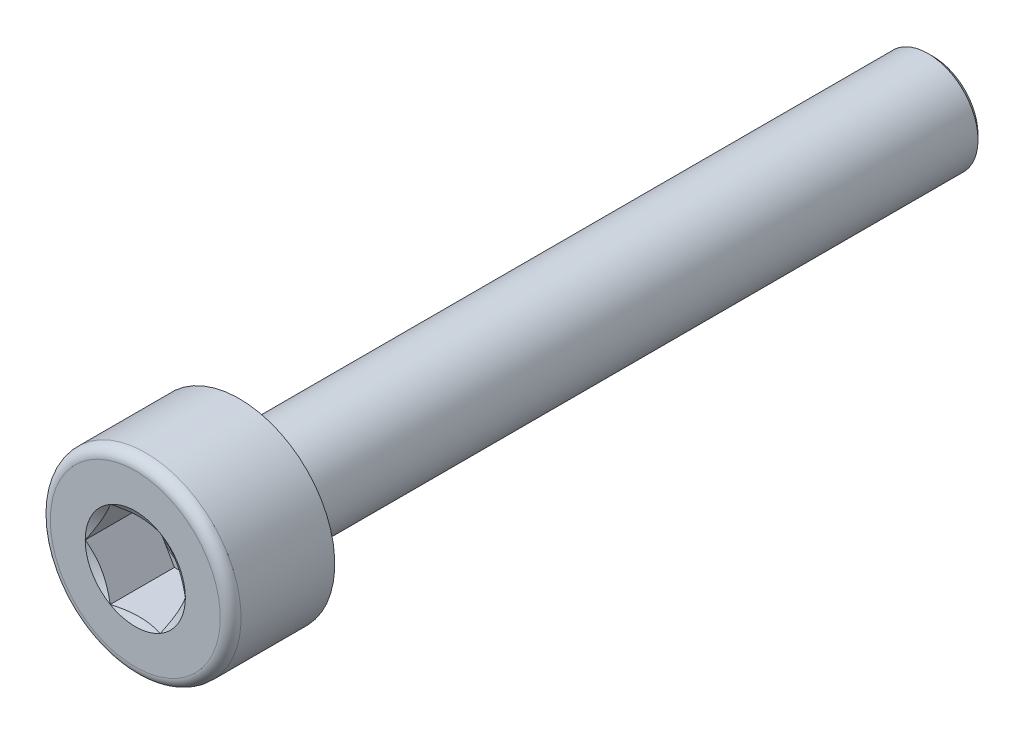
ISO-10303-21;
HEADER;
FILE_DESCRIPTION(('STEP AP214'),'2;1');
FILE_NAME('part.step','',(''),(''),'','','');
FILE_SCHEMA(('AUTOMOTIVE_DESIGN { 1 0 10303 214 1 1 1 1 }'));
ENDSEC;
DATA;
#1=APPLICATION_CONTEXT('core data for automotive mechanical design processes');
#2=APPLICATION_PROTOCOL_DEFINITION('international standard','automotive_design',2000,#1);
#3=PRODUCT_CONTEXT('',#1,'mechanical');
#4=PRODUCT('Part','Part','',(#3));
#5=PRODUCT_RELATED_PRODUCT_CATEGORY('part','',(#4));
#6=PRODUCT_DEFINITION_FORMATION('','',#4);
#7=PRODUCT_DEFINITION_CONTEXT('part definition',#1,'design');
#8=PRODUCT_DEFINITION('design','',#6,#7);
#9=PRODUCT_DEFINITION_SHAPE('','',#8);
#10=(LENGTH_UNIT() NAMED_UNIT(*) SI_UNIT(.MILLI.,.METRE.));
#11=(NAMED_UNIT(*) PLANE_ANGLE_UNIT() SI_UNIT($,.RADIAN.));
#12=(NAMED_UNIT(*) SI_UNIT($,.STERADIAN.) SOLID_ANGLE_UNIT());
#13=UNCERTAINTY_MEASURE_WITH_UNIT(LENGTH_MEASURE(1.E-05),#10,'distance_accuracy_value','');
#14=(GEOMETRIC_REPRESENTATION_CONTEXT(3) GLOBAL_UNCERTAINTY_ASSIGNED_CONTEXT((#13)) GLOBAL_UNIT_ASSIGNED_CONTEXT((#10,
#11,#12)) REPRESENTATION_CONTEXT('',''));
#15=CARTESIAN_POINT('',(0.,0.,0.));
#16=DIRECTION('',(0.,0.,1.));
#17=DIRECTION('',(1.,0.,0.));
#18=AXIS2_PLACEMENT_3D('',#15,#16,#17);
#19=CARTESIAN_POINT('',(0.,1.437,-20.));
#20=DIRECTION('',(0.,0.,1.));
#21=DIRECTION('',(1.,0.,0.));
#22=AXIS2_PLACEMENT_3D('',#19,#20,#21);
#23=PLANE('',#22);
#24=CARTESIAN_POINT('',(0.,0.,-20.));
#25=DIRECTION('',(0.,0.,1.));
#26=DIRECTION('',(1.,0.,0.));
#27=AXIS2_PLACEMENT_3D('',#24,#25,#26);
#28=CIRCLE('',#27,1.2933);
#29=CARTESIAN_POINT('',(1.2933,0.,-20.));
#30=VERTEX_POINT('',#29);
#31=EDGE_CURVE('E25',#30,#30,#28,.F.);
#32=ORIENTED_EDGE('',*,*,#31,.T.);
#33=EDGE_LOOP('',(#32));
#34=FACE_BOUND('',#33,.T.);
#35=ADVANCED_FACE('F17',(#34),#23,.F.);
#36=CARTESIAN_POINT('',(0.,0.,3.));
#37=DIRECTION('',(0.,0.,-1.));
#38=DIRECTION('',(-1.,0.,0.));
#39=AXIS2_PLACEMENT_3D('',#36,#37,#38);
#40=PLANE('',#39);
#41=CARTESIAN_POINT('',(0.,0.,3.));
#42=DIRECTION('',(0.,0.,-1.));
#43=DIRECTION('',(-1.,0.,0.));
#44=AXIS2_PLACEMENT_3D('',#41,#42,#43);
#45=CIRCLE('',#44,2.45);
#46=CARTESIAN_POINT('',(-2.45,0.,3.));
#47=VERTEX_POINT('',#46);
#48=EDGE_CURVE('E273',#47,#47,#45,.F.);
#49=ORIENTED_EDGE('',*,*,#48,.T.);
#50=EDGE_LOOP('',(#49));
#51=FACE_BOUND('',#50,.T.);
#52=CARTESIAN_POINT('',(0.,0.,3.));
#53=DIRECTION('',(0.,0.,-1.));
#54=DIRECTION('',(-1.,0.,0.));
#55=AXIS2_PLACEMENT_3D('',#52,#53,#54);
#56=CIRCLE('',#55,1.44337567297406);
#57=CARTESIAN_POINT('',(-0.721687836487033,-1.25,3.));
#58=VERTEX_POINT('',#57);
#59=CARTESIAN_POINT('',(-1.44337567297406,0.,3.));
#60=VERTEX_POINT('',#59);
#61=EDGE_CURVE('E284',#58,#60,#56,.T.);
#62=ORIENTED_EDGE('',*,*,#61,.T.);
#63=CARTESIAN_POINT('',(-0.72168783648703,1.25,3.));
#64=VERTEX_POINT('',#63);
#65=EDGE_CURVE('E107',#60,#64,#56,.T.);
#66=ORIENTED_EDGE('',*,*,#65,.T.);
#67=CARTESIAN_POINT('',(0.721687836487035,1.25,3.));
#68=VERTEX_POINT('',#67);
#69=EDGE_CURVE('E294',#64,#68,#56,.T.);
#70=ORIENTED_EDGE('',*,*,#69,.T.);
#71=CARTESIAN_POINT('',(1.44337567297406,0.,3.));
#72=VERTEX_POINT('',#71);
#73=EDGE_CURVE('E295',#68,#72,#56,.T.);
#74=ORIENTED_EDGE('',*,*,#73,.T.);
#75=CARTESIAN_POINT('',(0.721687836487033,-1.25,3.));
#76=VERTEX_POINT('',#75);
#77=EDGE_CURVE('E293',#72,#76,#56,.T.);
#78=ORIENTED_EDGE('',*,*,#77,.T.);
#79=EDGE_CURVE('E289',#76,#58,#56,.T.);
#80=ORIENTED_EDGE('',*,*,#79,.T.);
#81=EDGE_LOOP('',(#62,#66,#70,#74,#78,#80));
#82=FACE_BOUND('',#81,.T.);
#83=ADVANCED_FACE('F256',(#51,#82),#40,.F.);
#84=CARTESIAN_POINT('',(0.,0.,0.));
#85=DIRECTION('',(0.,0.,-1.));
#86=DIRECTION('',(-1.,0.,0.));
#87=AXIS2_PLACEMENT_3D('',#84,#85,#86);
#88=CYLINDRICAL_SURFACE('',#87,2.75);
#89=CARTESIAN_POINT('',(0.,0.,2.7));
#90=DIRECTION('',(0.,0.,-1.));
#91=DIRECTION('',(-1.,0.,0.));
#92=AXIS2_PLACEMENT_3D('',#89,#90,#91);
#93=CIRCLE('',#92,2.75);
#94=CARTESIAN_POINT('',(-2.75,0.,2.7));
#95=VERTEX_POINT('',#94);
#96=EDGE_CURVE('E175',#95,#95,#93,.T.);
#97=ORIENTED_EDGE('',*,*,#96,.T.);
#98=EDGE_LOOP('',(#97));
#99=FACE_BOUND('',#98,.T.);
#100=CARTESIAN_POINT('',(0.,0.,0.));
#101=DIRECTION('',(0.,0.,-1.));
#102=DIRECTION('',(-1.,0.,0.));
#103=AXIS2_PLACEMENT_3D('',#100,#101,#102);
#104=CIRCLE('',#103,2.75);
#105=CARTESIAN_POINT('',(-2.75,0.,0.));
#106=VERTEX_POINT('',#105);
#107=EDGE_CURVE('E117',#106,#106,#104,.T.);
#108=ORIENTED_EDGE('',*,*,#107,.F.);
#109=EDGE_LOOP('',(#108));
#110=FACE_BOUND('',#109,.T.);
#111=ADVANCED_FACE('F252',(#99,#110),#88,.T.);
#112=CARTESIAN_POINT('',(0.,2.75,0.));
#113=DIRECTION('',(0.,0.,1.));
#114=DIRECTION('',(1.,0.,0.));
#115=AXIS2_PLACEMENT_3D('',#112,#113,#114);
#116=PLANE('',#115);
#117=CARTESIAN_POINT('',(0.,0.,0.));
#118=DIRECTION('',(0.,0.,-1.));
#119=DIRECTION('',(-1.,0.,0.));
#120=AXIS2_PLACEMENT_3D('',#117,#118,#119);
#121=CIRCLE('',#120,1.8);
#122=CARTESIAN_POINT('',(-1.8,0.,0.));
#123=VERTEX_POINT('',#122);
#124=EDGE_CURVE('E161',#123,#123,#121,.T.);
#125=ORIENTED_EDGE('',*,*,#124,.F.);
#126=EDGE_LOOP('',(#125));
#127=FACE_BOUND('',#126,.T.);
#128=ORIENTED_EDGE('',*,*,#107,.T.);
#129=EDGE_LOOP('',(#128));
#130=FACE_BOUND('',#129,.T.);
#131=ADVANCED_FACE('F248',(#127,#130),#116,.F.);
#132=CARTESIAN_POINT('',(0.,0.,-0.100000000000001));
#133=DIRECTION('',(0.,0.,-1.));
#134=DIRECTION('',(-1.,0.,0.));
#135=AXIS2_PLACEMENT_3D('',#132,#133,#134);
#136=TOROIDAL_SURFACE('',#135,1.8,0.100000000000001);
#137=CARTESIAN_POINT('',(0.,0.,-0.0460072747777011));
#138=DIRECTION('',(0.,0.,-1.));
#139=DIRECTION('',(-1.,0.,0.));
#140=AXIS2_PLACEMENT_3D('',#137,#138,#139);
#141=CIRCLE('',#140,1.71582883140249);
#142=CARTESIAN_POINT('',(-1.71582883140249,0.,-0.0460072747777011));
#143=VERTEX_POINT('',#142);
#144=EDGE_CURVE('E158',#143,#143,#141,.T.);
#145=ORIENTED_EDGE('',*,*,#144,.F.);
#146=EDGE_LOOP('',(#145));
#147=FACE_BOUND('',#146,.T.);
#148=ORIENTED_EDGE('',*,*,#124,.T.);
#149=EDGE_LOOP('',(#148));
#150=FACE_BOUND('',#149,.T.);
#151=ADVANCED_FACE('F244',(#147,#150),#136,.F.);
#152=CARTESIAN_POINT('',(0.,0.,-0.0460072747777011));
#153=DIRECTION('',(0.,0.,1.));
#154=DIRECTION('',(1.,0.,0.));
#155=AXIS2_PLACEMENT_3D('',#152,#153,#154);
#156=CONICAL_SURFACE('',#155,1.71582883140249,0.570350678624392);
#157=CARTESIAN_POINT('',(0.,0.,-0.456007274777701));
#158=DIRECTION('',(0.,0.,-1.));
#159=DIRECTION('',(-1.,0.,0.));
#160=AXIS2_PLACEMENT_3D('',#157,#158,#159);
#161=CIRCLE('',#160,1.4528288314025);
#162=CARTESIAN_POINT('',(-1.4528288314025,0.,-0.456007274777701));
#163=VERTEX_POINT('',#162);
#164=EDGE_CURVE('E155',#163,#163,#161,.T.);
#165=ORIENTED_EDGE('',*,*,#164,.F.);
#166=EDGE_LOOP('',(#165));
#167=FACE_BOUND('',#166,.T.);
#168=ORIENTED_EDGE('',*,*,#144,.T.);
#169=EDGE_LOOP('',(#168));
#170=FACE_BOUND('',#169,.T.);
#171=ADVANCED_FACE('F240',(#167,#170),#156,.T.);
#172=CARTESIAN_POINT('',(0.,0.,-0.51));
#173=DIRECTION('',(0.,0.,-1.));
#174=DIRECTION('',(-1.,0.,0.));
#175=AXIS2_PLACEMENT_3D('',#172,#173,#174);
#176=TOROIDAL_SURFACE('',#175,1.537,0.1);
#177=CARTESIAN_POINT('',(0.,0.,-0.51));
#178=DIRECTION('',(0.,0.,-1.));
#179=DIRECTION('',(-1.,0.,0.));
#180=AXIS2_PLACEMENT_3D('',#177,#178,#179);
#181=CIRCLE('',#180,1.437);
#182=CARTESIAN_POINT('',(-1.437,0.,-0.51));
#183=VERTEX_POINT('',#182);
#184=EDGE_CURVE('E151',#183,#183,#181,.T.);
#185=ORIENTED_EDGE('',*,*,#184,.F.);
#186=EDGE_LOOP('',(#185));
#187=FACE_BOUND('',#186,.T.);
#188=ORIENTED_EDGE('',*,*,#164,.T.);
#189=EDGE_LOOP('',(#188));
#190=FACE_BOUND('',#189,.T.);
#191=ADVANCED_FACE('F236',(#187,#190),#176,.F.);
#192=CARTESIAN_POINT('',(0.,0.,0.));
#193=DIRECTION('',(0.,0.,-1.));
#194=DIRECTION('',(-1.,0.,0.));
#195=AXIS2_PLACEMENT_3D('',#192,#193,#194);
#196=CYLINDRICAL_SURFACE('',#195,1.437);
#197=CARTESIAN_POINT('',(0.,0.,-19.8563));
#198=DIRECTION('',(0.,0.,1.));
#199=DIRECTION('',(1.,0.,0.));
#200=AXIS2_PLACEMENT_3D('',#197,#198,#199);
#201=CIRCLE('',#200,1.437);
#202=CARTESIAN_POINT('',(1.437,0.,-19.8563));
#203=VERTEX_POINT('',#202);
#204=EDGE_CURVE('E11',#203,#203,#201,.T.);
#205=ORIENTED_EDGE('',*,*,#204,.T.);
#206=EDGE_LOOP('',(#205));
#207=FACE_BOUND('',#206,.T.);
#208=ORIENTED_EDGE('',*,*,#184,.T.);
#209=EDGE_LOOP('',(#208));
#210=FACE_BOUND('',#209,.T.);
#211=ADVANCED_FACE('F233',(#207,#210),#196,.T.);
#212=CARTESIAN_POINT('',(0.,0.,3.));
#213=DIRECTION('',(0.,0.,1.));
#214=DIRECTION('',(1.,0.,0.));
#215=AXIS2_PLACEMENT_3D('',#212,#213,#214);
#216=CONICAL_SURFACE('',#215,1.44337567297406,1.04719755119659);
#217=ORIENTED_EDGE('',*,*,#65,.F.);
#218=CARTESIAN_POINT('',(-1.4434911430279,-0.000199999999997675,3.00006667466602));
#219=CARTESIAN_POINT('',(-1.41177538446487,0.0547333052317676,2.98174591476369));
#220=CARTESIAN_POINT('',(-1.37978586023939,0.110140786500242,2.96508330620064));
#221=CARTESIAN_POINT('',(-1.31525277575269,0.221915367600343,2.93599730394577));
#222=CARTESIAN_POINT('',(-1.28270806805991,0.278284454841713,2.92358420197605));
#223=CARTESIAN_POINT('',(-1.21802202146378,0.390323974086987,2.90425968763601));
#224=CARTESIAN_POINT('',(-1.1858906404852,0.445977158459233,2.89721968944743));
#225=CARTESIAN_POINT('',(-1.12147653960455,0.557545653908395,2.88881243263063));
#226=CARTESIAN_POINT('',(-1.08919405413422,0.613460558937603,2.88743821520472));
#227=CARTESIAN_POINT('',(-1.02886247391297,0.717957921181728,2.89028333736792));
#228=CARTESIAN_POINT('',(-1.00080438896118,0.766555949881318,2.89380409882001));
#229=CARTESIAN_POINT('',(-0.944871034195502,0.863435362173241,2.90496711269925));
#230=CARTESIAN_POINT('',(-0.916995958125019,0.911716410192166,2.91261318557268));
#231=CARTESIAN_POINT('',(-0.860947097873546,1.00879588385404,2.93172945470053));
#232=CARTESIAN_POINT('',(-0.832780414607289,1.0575820103519,2.94328075697966));
#233=CARTESIAN_POINT('',(-0.776867365453648,1.1544262522921,2.96949831469389));
#234=CARTESIAN_POINT('',(-0.74912028215514,1.20248561032696,2.9841584021391));
#235=CARTESIAN_POINT('',(-0.721572366433193,1.2502,3.00006667466602));
#236=B_SPLINE_CURVE_WITH_KNOTS('',3,(#218,#219,#220,#221,#222,#223,#224,#225,#226,#227,#228,
#229,#230,#231,#232,#233,#234,#235),.UNSPECIFIED.,.F.,.F.,(4,2,2,2,2,2,2,2,4),(0.,
0.19815082102956,0.396778196315221,0.590488617354401,0.783961049317183,0.952480056398647,
1.1211553973001,1.2935743034359,1.4656542697693),.UNSPECIFIED.);
#237=EDGE_CURVE('E166',#60,#64,#236,.T.);
#238=ORIENTED_EDGE('',*,*,#237,.T.);
#239=EDGE_LOOP('',(#217,#238));
#240=FACE_BOUND('',#239,.T.);
#241=ADVANCED_FACE('F184',(#240),#216,.F.);
#242=CARTESIAN_POINT('',(-0.721572366433195,-1.2502,3.00006667466602));
#243=CARTESIAN_POINT('',(-0.753288124996231,-1.19526669476823,2.98174591476369));
#244=CARTESIAN_POINT('',(-0.785277649221704,-1.13985921349976,2.96508330620064));
#245=CARTESIAN_POINT('',(-0.849810733708404,-1.02808463239966,2.93599730394577));
#246=CARTESIAN_POINT('',(-0.882355441401183,-0.971715545158289,2.92358420197605));
#247=CARTESIAN_POINT('',(-0.947041487997319,-0.859676025913014,2.90425968763601));
#248=CARTESIAN_POINT('',(-0.979172868975895,-0.804022841540769,2.89721968944743));
#249=CARTESIAN_POINT('',(-1.04358696985655,-0.692454346091607,2.88881243263063));
#250=CARTESIAN_POINT('',(-1.07586945532688,-0.636539441062398,2.88743821520472));
#251=CARTESIAN_POINT('',(-1.13620103554813,-0.532042078818273,2.89028333736791));
#252=CARTESIAN_POINT('',(-1.16425912049992,-0.483444050118683,2.89380409882001));
#253=CARTESIAN_POINT('',(-1.22019247526559,-0.386564637826761,2.90496711269926));
#254=CARTESIAN_POINT('',(-1.24806755133608,-0.338283589807835,2.91261318557268));
#255=CARTESIAN_POINT('',(-1.30411641158755,-0.241204116145956,2.93172945470053));
#256=CARTESIAN_POINT('',(-1.33228309485381,-0.1924179896481,2.94328075697966));
#257=CARTESIAN_POINT('',(-1.38819614400745,-0.0955737477078969,2.96949831469389));
#258=CARTESIAN_POINT('',(-1.41594322730596,-0.0475143896730343,2.98415840213911));
#259=CARTESIAN_POINT('',(-1.4434911430279,0.000200000000002268,3.00006667466602));
#260=B_SPLINE_CURVE_WITH_KNOTS('',3,(#242,#243,#244,#245,#246,#247,#248,#249,#250,#251,#252,
#253,#254,#255,#256,#257,#258,#259),.UNSPECIFIED.,.F.,.F.,(4,2,2,2,2,2,2,2,4),(0.,
0.19815082102956,0.396778196315222,0.590488617354402,0.783961049317184,0.952480056398648,
1.1211553973001,1.2935743034359,1.4656542697693),.UNSPECIFIED.);
#261=EDGE_CURVE('E106',#58,#60,#260,.T.);
#262=ORIENTED_EDGE('',*,*,#261,.T.);
#263=ORIENTED_EDGE('',*,*,#61,.F.);
#264=EDGE_LOOP('',(#262,#263));
#265=FACE_BOUND('',#264,.T.);
#266=ADVANCED_FACE('F339',(#265),#216,.F.);
#267=CARTESIAN_POINT('',(-1.91402249686216,-1.25,3.48651288479141));
#268=CARTESIAN_POINT('',(-1.85914046049582,-1.25,3.45999038335154));
#269=CARTESIAN_POINT('',(-1.80412861642413,-1.25,3.43373221461557));
#270=CARTESIAN_POINT('',(-1.69377524880197,-1.25,3.38189383879485));
#271=CARTESIAN_POINT('',(-1.63843367017623,-1.25,3.35631374909162));
#272=CARTESIAN_POINT('',(-1.52705181896546,-1.25,3.30584606568502));
#273=CARTESIAN_POINT('',(-1.471009360369,-1.25,3.28096327255609));
#274=CARTESIAN_POINT('',(-1.3584634322514,-1.25,3.23227191506865));
#275=CARTESIAN_POINT('',(-1.30195998694251,-1.25,3.20846329471518));
#276=CARTESIAN_POINT('',(-1.13023285932381,-1.25,3.13847265448235));
#277=CARTESIAN_POINT('',(-1.01415191825627,-1.25,3.09435658102078));
#278=CARTESIAN_POINT('',(-0.779052794443726,-1.25,3.01526341646949));
#279=CARTESIAN_POINT('',(-0.660042536750821,-1.25,2.98026411818164));
#280=CARTESIAN_POINT('',(-0.47893263622699,-1.25,2.93885499673143));
#281=CARTESIAN_POINT('',(-0.418117317139982,-1.25,2.92689892661569));
#282=CARTESIAN_POINT('',(-0.295751634794787,-1.25,2.90750168027795));
#283=CARTESIAN_POINT('',(-0.234201270886778,-1.25,2.90006050804768));
#284=CARTESIAN_POINT('',(-0.111078085132805,-1.25,2.89034953143358));
#285=CARTESIAN_POINT('',(-0.0495079196542184,-1.25,2.88804698816604));
#286=CARTESIAN_POINT('',(0.0735831621738639,-1.25,2.88872894537047));
#287=CARTESIAN_POINT('',(0.135104087159245,-1.25,2.89171207343273));
#288=CARTESIAN_POINT('',(0.283935785341007,-1.25,2.90505722791002));
#289=CARTESIAN_POINT('',(0.371012804095998,-1.25,2.91803134932696));
#290=CARTESIAN_POINT('',(0.543555810943381,-1.25,2.95222917957144));
#291=CARTESIAN_POINT('',(0.629019779096373,-1.25,2.9734625943366));
#292=CARTESIAN_POINT('',(0.756929416866877,-1.25,3.01007884490288));
#293=CARTESIAN_POINT('',(0.800029095074483,-1.25,3.02326523899134));
#294=CARTESIAN_POINT('',(0.885776202763547,-1.25,3.05094330554174));
#295=CARTESIAN_POINT('',(0.928423921808507,-1.25,3.06543407771215));
#296=CARTESIAN_POINT('',(1.01309180163563,-1.25,3.09541882069064));
#297=CARTESIAN_POINT('',(1.05511414357455,-1.25,3.11090668572693));
#298=CARTESIAN_POINT('',(1.13883279115284,-1.25,3.14279147043058));
#299=CARTESIAN_POINT('',(1.1805289571388,-1.25,3.15918875750689));
#300=CARTESIAN_POINT('',(1.22207405933337,-1.25,3.175951067698));
#301=B_SPLINE_CURVE_WITH_KNOTS('',3,(#267,#268,#269,#270,#271,#272,#273,#274,#275,#276,#277,
#278,#279,#280,#281,#282,#283,#284,#285,#286,#287,#288,#289,#290,#291,#292,#293,#294,#295,#296,
#297,#298,#299,#300),.UNSPECIFIED.,.F.,.F.,(4,2,2,2,2,2,2,2,2,2,2,2,2,2,2,2,4),(0.,
0.182866185166336,0.365763822062273,0.549708108268721,0.733642794640087,1.10600436119169,
1.47745024072251,1.66325057096118,1.84905106547046,2.03366437966803,2.21822976656131,
2.48180397426805,2.74568886248364,2.88088820791444,3.01599494297259,3.15034120655594,
3.28474214746062),.UNSPECIFIED.);
#302=EDGE_CURVE('E197',#76,#58,#301,.F.);
#303=ORIENTED_EDGE('',*,*,#302,.T.);
#304=ORIENTED_EDGE('',*,*,#79,.F.);
#305=EDGE_LOOP('',(#303,#304));
#306=FACE_BOUND('',#305,.T.);
#307=ADVANCED_FACE('F343',(#306),#216,.F.);
#308=CARTESIAN_POINT('',(1.4434911430279,0.000199999999998967,3.00006667466602));
#309=CARTESIAN_POINT('',(1.41177538446487,-0.0547333052317663,2.98174591476369));
#310=CARTESIAN_POINT('',(1.37978586023939,-0.110140786500241,2.96508330620064));
#311=CARTESIAN_POINT('',(1.31525277575269,-0.221915367600341,2.93599730394577));
#312=CARTESIAN_POINT('',(1.28270806805991,-0.278284454841712,2.92358420197605));
#313=CARTESIAN_POINT('',(1.21802202146378,-0.390323974086986,2.90425968763601));
#314=CARTESIAN_POINT('',(1.1858906404852,-0.445977158459232,2.89721968944743));
#315=CARTESIAN_POINT('',(1.12147653960455,-0.557545653908394,2.88881243263063));
#316=CARTESIAN_POINT('',(1.08919405413422,-0.613460558937602,2.88743821520472));
#317=CARTESIAN_POINT('',(1.02886247391297,-0.717957921181727,2.89028333736791));
#318=CARTESIAN_POINT('',(1.00080438896118,-0.766555949881317,2.89380409882001));
#319=CARTESIAN_POINT('',(0.944871034195502,-0.863435362173239,2.90496711269925));
#320=CARTESIAN_POINT('',(0.916995958125019,-0.911716410192164,2.91261318557268));
#321=CARTESIAN_POINT('',(0.860947097873545,-1.00879588385404,2.93172945470053));
#322=CARTESIAN_POINT('',(0.832780414607289,-1.0575820103519,2.94328075697966));
#323=CARTESIAN_POINT('',(0.776867365453648,-1.1544262522921,2.96949831469389));
#324=CARTESIAN_POINT('',(0.749120282155139,-1.20248561032696,2.9841584021391));
#325=CARTESIAN_POINT('',(0.721572366433193,-1.2502,3.00006667466602));
#326=B_SPLINE_CURVE_WITH_KNOTS('',3,(#308,#309,#310,#311,#312,#313,#314,#315,#316,#317,#318,
#319,#320,#321,#322,#323,#324,#325),.UNSPECIFIED.,.F.,.F.,(4,2,2,2,2,2,2,2,4),(0.,
0.19815082102956,0.396778196315222,0.590488617354401,0.783961049317183,0.952480056398647,
1.1211553973001,1.2935743034359,1.4656542697693),.UNSPECIFIED.);
#327=EDGE_CURVE('E204',#72,#76,#326,.T.);
#328=ORIENTED_EDGE('',*,*,#327,.T.);
#329=ORIENTED_EDGE('',*,*,#77,.F.);
#330=EDGE_LOOP('',(#328,#329));
#331=FACE_BOUND('',#330,.T.);
#332=ADVANCED_FACE('F299',(#331),#216,.F.);
#333=CARTESIAN_POINT('',(0.721572366433196,1.2502,3.00006667466602));
#334=CARTESIAN_POINT('',(0.753288124996232,1.19526669476823,2.98174591476369));
#335=CARTESIAN_POINT('',(0.785277649221705,1.13985921349976,2.96508330620064));
#336=CARTESIAN_POINT('',(0.849810733708406,1.02808463239966,2.93599730394577));
#337=CARTESIAN_POINT('',(0.882355441401184,0.971715545158289,2.92358420197605));
#338=CARTESIAN_POINT('',(0.94704148799732,0.859676025913015,2.90425968763601));
#339=CARTESIAN_POINT('',(0.979172868975896,0.80402284154077,2.89721968944743));
#340=CARTESIAN_POINT('',(1.04358696985655,0.692454346091607,2.88881243263063));
#341=CARTESIAN_POINT('',(1.07586945532687,0.636539441062397,2.88743821520472));
#342=CARTESIAN_POINT('',(1.13620103554813,0.532042078818272,2.89028333736792));
#343=CARTESIAN_POINT('',(1.16425912049992,0.483444050118682,2.89380409882001));
#344=CARTESIAN_POINT('',(1.2201924752656,0.38656463782676,2.90496711269925));
#345=CARTESIAN_POINT('',(1.24806755133608,0.338283589807835,2.91261318557268));
#346=CARTESIAN_POINT('',(1.30411641158755,0.241204116145956,2.93172945470053));
#347=CARTESIAN_POINT('',(1.33228309485381,0.1924179896481,2.94328075697966));
#348=CARTESIAN_POINT('',(1.38819614400745,0.0955737477078979,2.96949831469389));
#349=CARTESIAN_POINT('',(1.41594322730596,0.0475143896730355,2.98415840213911));
#350=CARTESIAN_POINT('',(1.4434911430279,-0.00020000000000122,3.00006667466602));
#351=B_SPLINE_CURVE_WITH_KNOTS('',3,(#333,#334,#335,#336,#337,#338,#339,#340,#341,#342,#343,
#344,#345,#346,#347,#348,#349,#350),.UNSPECIFIED.,.F.,.F.,(4,2,2,2,2,2,2,2,4),(0.,
0.19815082102956,0.396778196315222,0.590488617354401,0.783961049317184,0.952480056398648,
1.1211553973001,1.2935743034359,1.4656542697693),.UNSPECIFIED.);
#352=EDGE_CURVE('E37',#68,#72,#351,.T.);
#353=ORIENTED_EDGE('',*,*,#352,.T.);
#354=ORIENTED_EDGE('',*,*,#73,.F.);
#355=EDGE_LOOP('',(#353,#354));
#356=FACE_BOUND('',#355,.T.);
#357=ADVANCED_FACE('F183',(#356),#216,.F.);
#358=CARTESIAN_POINT('',(-1.91402249686216,1.25,3.48651288479141));
#359=CARTESIAN_POINT('',(-1.85914046049581,1.25,3.45999038335154));
#360=CARTESIAN_POINT('',(-1.80412861642413,1.25,3.43373221461557));
#361=CARTESIAN_POINT('',(-1.69377524880197,1.25,3.38189383879485));
#362=CARTESIAN_POINT('',(-1.63843367017622,1.25,3.35631374909161));
#363=CARTESIAN_POINT('',(-1.52705181896546,1.25,3.30584606568501));
#364=CARTESIAN_POINT('',(-1.471009360369,1.25,3.28096327255609));
#365=CARTESIAN_POINT('',(-1.35846343225139,1.25,3.23227191506865));
#366=CARTESIAN_POINT('',(-1.3019599869425,1.25,3.20846329471518));
#367=CARTESIAN_POINT('',(-1.13023285932381,1.25,3.13847265448235));
#368=CARTESIAN_POINT('',(-1.01415191825627,1.25,3.09435658102077));
#369=CARTESIAN_POINT('',(-0.779052794443723,1.25,3.01526341646949));
#370=CARTESIAN_POINT('',(-0.660042536750817,1.25,2.98026411818164));
#371=CARTESIAN_POINT('',(-0.478932636226987,1.25,2.93885499673143));
#372=CARTESIAN_POINT('',(-0.418117317139979,1.25,2.92689892661569));
#373=CARTESIAN_POINT('',(-0.295751634794785,1.25,2.90750168027795));
#374=CARTESIAN_POINT('',(-0.234201270886775,1.25,2.90006050804768));
#375=CARTESIAN_POINT('',(-0.111078085132802,1.25,2.89034953143358));
#376=CARTESIAN_POINT('',(-0.0495079196542156,1.25,2.88804698816604));
#377=CARTESIAN_POINT('',(0.0735831621738667,1.25,2.88872894537047));
#378=CARTESIAN_POINT('',(0.135104087159248,1.25,2.89171207343273));
#379=CARTESIAN_POINT('',(0.283935785341009,1.25,2.90505722791002));
#380=CARTESIAN_POINT('',(0.371012804096,1.25,2.91803134932696));
#381=CARTESIAN_POINT('',(0.543555810943384,1.25,2.95222917957144));
#382=CARTESIAN_POINT('',(0.629019779096376,1.25,2.9734625943366));
#383=CARTESIAN_POINT('',(0.75692941686688,1.25,3.01007884490288));
#384=CARTESIAN_POINT('',(0.800029095074486,1.25,3.02326523899134));
#385=CARTESIAN_POINT('',(0.88577620276355,1.25,3.05094330554174));
#386=CARTESIAN_POINT('',(0.92842392180851,1.25,3.06543407771215));
#387=CARTESIAN_POINT('',(1.01309180163563,1.25,3.09541882069064));
#388=CARTESIAN_POINT('',(1.05511414357455,1.25,3.11090668572694));
#389=CARTESIAN_POINT('',(1.13883279115285,1.25,3.14279147043058));
#390=CARTESIAN_POINT('',(1.1805289571388,1.25,3.15918875750689));
#391=CARTESIAN_POINT('',(1.22207405933337,1.25,3.175951067698));
#392=B_SPLINE_CURVE_WITH_KNOTS('',3,(#358,#359,#360,#361,#362,#363,#364,#365,#366,#367,#368,
#369,#370,#371,#372,#373,#374,#375,#376,#377,#378,#379,#380,#381,#382,#383,#384,#385,#386,#387,
#388,#389,#390,#391),.UNSPECIFIED.,.F.,.F.,(4,2,2,2,2,2,2,2,2,2,2,2,2,2,2,2,4),(0.,
0.182866185166335,0.365763822062272,0.549708108268719,0.733642794640086,1.10600436119169,
1.47745024072251,1.66325057096118,1.84905106547045,2.03366437966803,2.21822976656131,
2.48180397426804,2.74568886248363,2.88088820791444,3.01599494297259,3.15034120655594,
3.28474214746062),.UNSPECIFIED.);
#393=EDGE_CURVE('E31',#64,#68,#392,.T.);
#394=ORIENTED_EDGE('',*,*,#393,.T.);
#395=ORIENTED_EDGE('',*,*,#69,.F.);
#396=EDGE_LOOP('',(#394,#395));
#397=FACE_BOUND('',#396,.T.);
#398=ADVANCED_FACE('F180',(#397),#216,.F.);
#399=CARTESIAN_POINT('',(0.721687836487034,1.25,1.15));
#400=DIRECTION('',(0.,0.,-1.));
#401=DIRECTION('',(-1.,0.,0.));
#402=AXIS2_PLACEMENT_3D('',#399,#400,#401);
#403=PLANE('',#402);
#404=CARTESIAN_POINT('',(0.,0.,1.15));
#405=DIRECTION('',(0.,0.,-1.));
#406=DIRECTION('',(-1.,0.,0.));
#407=AXIS2_PLACEMENT_3D('',#404,#405,#406);
#408=CIRCLE('',#407,1.25);
#409=CARTESIAN_POINT('',(-1.08253175473055,0.625,1.15));
#410=VERTEX_POINT('',#409);
#411=CARTESIAN_POINT('',(0.,1.25,1.15));
#412=VERTEX_POINT('',#411);
#413=EDGE_CURVE('E96',#410,#412,#408,.T.);
#414=ORIENTED_EDGE('',*,*,#413,.T.);
#415=DIRECTION('',(1.,0.,0.));
#416=VECTOR('',#415,1.);
#417=CARTESIAN_POINT('',(-0.721687836487031,1.25,1.15));
#418=LINE('',#417,#416);
#419=CARTESIAN_POINT('',(-0.721687836487031,1.25,1.15));
#420=VERTEX_POINT('',#419);
#421=EDGE_CURVE('E123',#420,#412,#418,.T.);
#422=ORIENTED_EDGE('',*,*,#421,.F.);
#423=DIRECTION('',(0.5,0.866025403784438,0.));
#424=VECTOR('',#423,1.);
#425=CARTESIAN_POINT('',(-1.44337567297406,0.,1.15));
#426=LINE('',#425,#424);
#427=EDGE_CURVE('E120',#410,#420,#426,.T.);
#428=ORIENTED_EDGE('',*,*,#427,.F.);
#429=EDGE_LOOP('',(#414,#422,#428));
#430=FACE_BOUND('',#429,.T.);
#431=ADVANCED_FACE('F121',(#430),#403,.F.);
#432=CARTESIAN_POINT('',(0.,0.,1.15));
#433=DIRECTION('',(0.,0.,-1.));
#434=DIRECTION('',(-1.,0.,0.));
#435=AXIS2_PLACEMENT_3D('',#432,#433,#434);
#436=CIRCLE('',#435,1.25);
#437=CARTESIAN_POINT('',(-1.08253175473055,-0.625,1.15));
#438=VERTEX_POINT('',#437);
#439=EDGE_CURVE('E98',#410,#438,#436,.F.);
#440=ORIENTED_EDGE('',*,*,#439,.F.);
#441=CARTESIAN_POINT('',(-1.44337567297406,0.,1.15));
#442=VERTEX_POINT('',#441);
#443=EDGE_CURVE('E114',#442,#410,#426,.T.);
#444=ORIENTED_EDGE('',*,*,#443,.F.);
#445=DIRECTION('',(-0.5,0.866025403784439,0.));
#446=VECTOR('',#445,1.);
#447=CARTESIAN_POINT('',(-0.721687836487033,-1.25,1.15));
#448=LINE('',#447,#446);
#449=EDGE_CURVE('E115',#438,#442,#448,.T.);
#450=ORIENTED_EDGE('',*,*,#449,.F.);
#451=EDGE_LOOP('',(#440,#444,#450));
#452=FACE_BOUND('',#451,.T.);
#453=ADVANCED_FACE('F112',(#452),#403,.F.);
#454=CARTESIAN_POINT('',(-1.44337567297406,0.,3.));
#455=DIRECTION('',(-0.866025403784438,0.5,0.));
#456=DIRECTION('',(-0.5,-0.866025403784438,0.));
#457=AXIS2_PLACEMENT_3D('',#454,#455,#456);
#458=PLANE('',#457);
#459=ORIENTED_EDGE('',*,*,#443,.T.);
#460=ORIENTED_EDGE('',*,*,#427,.T.);
#461=DIRECTION('',(0.,0.,-1.));
#462=VECTOR('',#461,1.);
#463=CARTESIAN_POINT('',(-0.721687836487031,1.25,3.));
#464=LINE('',#463,#462);
#465=EDGE_CURVE('E134',#64,#420,#464,.T.);
#466=ORIENTED_EDGE('',*,*,#465,.F.);
#467=ORIENTED_EDGE('',*,*,#237,.F.);
#468=DIRECTION('',(0.,0.,-1.));
#469=VECTOR('',#468,1.);
#470=CARTESIAN_POINT('',(-1.44337567297406,0.,3.));
#471=LINE('',#470,#469);
#472=EDGE_CURVE('E133',#60,#442,#471,.T.);
#473=ORIENTED_EDGE('',*,*,#472,.T.);
#474=EDGE_LOOP('',(#459,#460,#466,#467,#473));
#475=FACE_BOUND('',#474,.T.);
#476=ADVANCED_FACE('F130',(#475),#458,.F.);
#477=CARTESIAN_POINT('',(0.,-1.25,1.15));
#478=VERTEX_POINT('',#477);
#479=EDGE_CURVE('E119',#438,#478,#436,.F.);
#480=ORIENTED_EDGE('',*,*,#479,.F.);
#481=CARTESIAN_POINT('',(-0.721687836487033,-1.25,1.15));
#482=VERTEX_POINT('',#481);
#483=EDGE_CURVE('E127',#482,#438,#448,.T.);
#484=ORIENTED_EDGE('',*,*,#483,.F.);
#485=DIRECTION('',(-1.,0.,0.));
#486=VECTOR('',#485,1.);
#487=CARTESIAN_POINT('',(0.721687836487031,-1.25,1.15));
#488=LINE('',#487,#486);
#489=EDGE_CURVE('E318',#478,#482,#488,.T.);
#490=ORIENTED_EDGE('',*,*,#489,.F.);
#491=EDGE_LOOP('',(#480,#484,#490));
#492=FACE_BOUND('',#491,.T.);
#493=ADVANCED_FACE('F331',(#492),#403,.F.);
#494=CARTESIAN_POINT('',(-0.721687836487033,-1.25,3.));
#495=DIRECTION('',(-0.866025403784439,-0.5,0.));
#496=DIRECTION('',(0.5,-0.866025403784439,0.));
#497=AXIS2_PLACEMENT_3D('',#494,#495,#496);
#498=PLANE('',#497);
#499=ORIENTED_EDGE('',*,*,#483,.T.);
#500=ORIENTED_EDGE('',*,*,#449,.T.);
#501=ORIENTED_EDGE('',*,*,#472,.F.);
#502=ORIENTED_EDGE('',*,*,#261,.F.);
#503=DIRECTION('',(0.,0.,-1.));
#504=VECTOR('',#503,1.);
#505=CARTESIAN_POINT('',(-0.721687836487033,-1.25,3.));
#506=LINE('',#505,#504);
#507=EDGE_CURVE('E140',#58,#482,#506,.T.);
#508=ORIENTED_EDGE('',*,*,#507,.T.);
#509=EDGE_LOOP('',(#499,#500,#501,#502,#508));
#510=FACE_BOUND('',#509,.T.);
#511=ADVANCED_FACE('F330',(#510),#498,.F.);
#512=CARTESIAN_POINT('',(1.08253175473055,-0.625,1.15));
#513=VERTEX_POINT('',#512);
#514=EDGE_CURVE('E333',#478,#513,#436,.F.);
#515=ORIENTED_EDGE('',*,*,#514,.F.);
#516=CARTESIAN_POINT('',(0.721687836487031,-1.25,1.15));
#517=VERTEX_POINT('',#516);
#518=EDGE_CURVE('E319',#517,#478,#488,.T.);
#519=ORIENTED_EDGE('',*,*,#518,.F.);
#520=DIRECTION('',(-0.5,-0.866025403784438,0.));
#521=VECTOR('',#520,1.);
#522=CARTESIAN_POINT('',(1.44337567297406,0.,1.15));
#523=LINE('',#522,#521);
#524=EDGE_CURVE('E314',#513,#517,#523,.T.);
#525=ORIENTED_EDGE('',*,*,#524,.F.);
#526=EDGE_LOOP('',(#515,#519,#525));
#527=FACE_BOUND('',#526,.T.);
#528=ADVANCED_FACE('F349',(#527),#403,.F.);
#529=CARTESIAN_POINT('',(0.721687836487031,-1.25,3.));
#530=DIRECTION('',(0.,-1.,0.));
#531=DIRECTION('',(0.,0.,-1.));
#532=AXIS2_PLACEMENT_3D('',#529,#530,#531);
#533=PLANE('',#532);
#534=ORIENTED_EDGE('',*,*,#518,.T.);
#535=ORIENTED_EDGE('',*,*,#489,.T.);
#536=ORIENTED_EDGE('',*,*,#507,.F.);
#537=ORIENTED_EDGE('',*,*,#302,.F.);
#538=DIRECTION('',(0.,0.,-1.));
#539=VECTOR('',#538,1.);
#540=CARTESIAN_POINT('',(0.721687836487031,-1.25,3.));
#541=LINE('',#540,#539);
#542=EDGE_CURVE('E143',#76,#517,#541,.T.);
#543=ORIENTED_EDGE('',*,*,#542,.T.);
#544=EDGE_LOOP('',(#534,#535,#536,#537,#543));
#545=FACE_BOUND('',#544,.T.);
#546=ADVANCED_FACE('F325',(#545),#533,.F.);
#547=CARTESIAN_POINT('',(1.08253175473055,0.625,1.15));
#548=VERTEX_POINT('',#547);
#549=EDGE_CURVE('E334',#513,#548,#436,.F.);
#550=ORIENTED_EDGE('',*,*,#549,.F.);
#551=CARTESIAN_POINT('',(1.44337567297406,0.,1.15));
#552=VERTEX_POINT('',#551);
#553=EDGE_CURVE('E317',#552,#513,#523,.T.);
#554=ORIENTED_EDGE('',*,*,#553,.F.);
#555=DIRECTION('',(0.5,-0.866025403784439,0.));
#556=VECTOR('',#555,1.);
#557=CARTESIAN_POINT('',(0.721687836487034,1.25,1.15));
#558=LINE('',#557,#556);
#559=EDGE_CURVE('E308',#548,#552,#558,.T.);
#560=ORIENTED_EDGE('',*,*,#559,.F.);
#561=EDGE_LOOP('',(#550,#554,#560));
#562=FACE_BOUND('',#561,.T.);
#563=ADVANCED_FACE('F350',(#562),#403,.F.);
#564=CARTESIAN_POINT('',(1.44337567297406,0.,3.));
#565=DIRECTION('',(0.866025403784438,-0.5,0.));
#566=DIRECTION('',(0.5,0.866025403784438,0.));
#567=AXIS2_PLACEMENT_3D('',#564,#565,#566);
#568=PLANE('',#567);
#569=ORIENTED_EDGE('',*,*,#553,.T.);
#570=ORIENTED_EDGE('',*,*,#524,.T.);
#571=ORIENTED_EDGE('',*,*,#542,.F.);
#572=ORIENTED_EDGE('',*,*,#327,.F.);
#573=DIRECTION('',(0.,0.,-1.));
#574=VECTOR('',#573,1.);
#575=CARTESIAN_POINT('',(1.44337567297406,0.,3.));
#576=LINE('',#575,#574);
#577=EDGE_CURVE('E146',#72,#552,#576,.T.);
#578=ORIENTED_EDGE('',*,*,#577,.T.);
#579=EDGE_LOOP('',(#569,#570,#571,#572,#578));
#580=FACE_BOUND('',#579,.T.);
#581=ADVANCED_FACE('F227',(#580),#568,.F.);
#582=EDGE_CURVE('E101',#548,#412,#436,.F.);
#583=ORIENTED_EDGE('',*,*,#582,.F.);
#584=CARTESIAN_POINT('',(0.721687836487034,1.25,1.15));
#585=VERTEX_POINT('',#584);
#586=EDGE_CURVE('E310',#585,#548,#558,.T.);
#587=ORIENTED_EDGE('',*,*,#586,.F.);
#588=EDGE_CURVE('E315',#412,#585,#418,.T.);
#589=ORIENTED_EDGE('',*,*,#588,.F.);
#590=EDGE_LOOP('',(#583,#587,#589));
#591=FACE_BOUND('',#590,.T.);
#592=ADVANCED_FACE('F225',(#591),#403,.F.);
#593=CARTESIAN_POINT('',(0.721687836487034,1.25,3.));
#594=DIRECTION('',(0.866025403784439,0.5,0.));
#595=DIRECTION('',(-0.5,0.866025403784439,0.));
#596=AXIS2_PLACEMENT_3D('',#593,#594,#595);
#597=PLANE('',#596);
#598=ORIENTED_EDGE('',*,*,#586,.T.);
#599=ORIENTED_EDGE('',*,*,#559,.T.);
#600=ORIENTED_EDGE('',*,*,#577,.F.);
#601=ORIENTED_EDGE('',*,*,#352,.F.);
#602=DIRECTION('',(0.,0.,-1.));
#603=VECTOR('',#602,1.);
#604=CARTESIAN_POINT('',(0.721687836487034,1.25,3.));
#605=LINE('',#604,#603);
#606=EDGE_CURVE('E149',#68,#585,#605,.T.);
#607=ORIENTED_EDGE('',*,*,#606,.T.);
#608=EDGE_LOOP('',(#598,#599,#600,#601,#607));
#609=FACE_BOUND('',#608,.T.);
#610=ADVANCED_FACE('F222',(#609),#597,.F.);
#611=CARTESIAN_POINT('',(-0.721687836487031,1.25,3.));
#612=DIRECTION('',(0.,1.,0.));
#613=DIRECTION('',(0.,0.,1.));
#614=AXIS2_PLACEMENT_3D('',#611,#612,#613);
#615=PLANE('',#614);
#616=ORIENTED_EDGE('',*,*,#421,.T.);
#617=ORIENTED_EDGE('',*,*,#588,.T.);
#618=ORIENTED_EDGE('',*,*,#606,.F.);
#619=ORIENTED_EDGE('',*,*,#393,.F.);
#620=ORIENTED_EDGE('',*,*,#465,.T.);
#621=EDGE_LOOP('',(#616,#617,#618,#619,#620));
#622=FACE_BOUND('',#621,.T.);
#623=ADVANCED_FACE('F93',(#622),#615,.F.);
#624=CARTESIAN_POINT('',(0.,0.,1.15));
#625=DIRECTION('',(0.,0.,1.));
#626=DIRECTION('',(1.,0.,0.));
#627=AXIS2_PLACEMENT_3D('',#624,#625,#626);
#628=CONICAL_SURFACE('',#627,1.25,1.0471975511966);
#629=CARTESIAN_POINT('',(0.,0.,0.428312163512963));
#630=VERTEX_POINT('',#629);
#631=VERTEX_LOOP('',#630);
#632=FACE_BOUND('',#631,.T.);
#633=ORIENTED_EDGE('',*,*,#413,.F.);
#634=ORIENTED_EDGE('',*,*,#439,.T.);
#635=ORIENTED_EDGE('',*,*,#479,.T.);
#636=ORIENTED_EDGE('',*,*,#514,.T.);
#637=ORIENTED_EDGE('',*,*,#549,.T.);
#638=ORIENTED_EDGE('',*,*,#582,.T.);
#639=EDGE_LOOP('',(#633,#634,#635,#636,#637,#638));
#640=FACE_BOUND('',#639,.T.);
#641=ADVANCED_FACE('F89',(#632,#640),#628,.F.);
#642=CARTESIAN_POINT('',(0.,0.,2.7));
#643=DIRECTION('',(0.,0.,-1.));
#644=DIRECTION('',(-1.,0.,0.));
#645=AXIS2_PLACEMENT_3D('',#642,#643,#644);
#646=TOROIDAL_SURFACE('',#645,2.45,0.3);
#647=ORIENTED_EDGE('',*,*,#48,.F.);
#648=EDGE_LOOP('',(#647));
#649=FACE_BOUND('',#648,.T.);
#650=ORIENTED_EDGE('',*,*,#96,.F.);
#651=EDGE_LOOP('',(#650));
#652=FACE_BOUND('',#651,.T.);
#653=ADVANCED_FACE('F92',(#649,#652),#646,.T.);
#654=CARTESIAN_POINT('',(0.,0.,-20.));
#655=DIRECTION('',(0.,0.,1.));
#656=DIRECTION('',(1.,0.,0.));
#657=AXIS2_PLACEMENT_3D('',#654,#655,#656);
#658=CONICAL_SURFACE('',#657,1.2933,0.785398163397448);
#659=ORIENTED_EDGE('',*,*,#204,.F.);
#660=EDGE_LOOP('',(#659));
#661=FACE_BOUND('',#660,.T.);
#662=ORIENTED_EDGE('',*,*,#31,.F.);
#663=EDGE_LOOP('',(#662));
#664=FACE_BOUND('',#663,.T.);
#665=ADVANCED_FACE('F19',(#661,#664),#658,.T.);
#666=CLOSED_SHELL('',(#35,#83,#111,#131,#151,#171,#191,#211,#241,#266,#307,#332,#357,#398,#431,
#453,#476,#493,#511,#528,#546,#563,#581,#592,#610,#623,#641,#653,#665));
#667=MANIFOLD_SOLID_BREP('B1',#666);
#668=ADVANCED_BREP_SHAPE_REPRESENTATION('',(#18,#667),#14);
#669=SHAPE_DEFINITION_REPRESENTATION(#9,#668);
ENDSEC;
END-ISO-10303-21;
